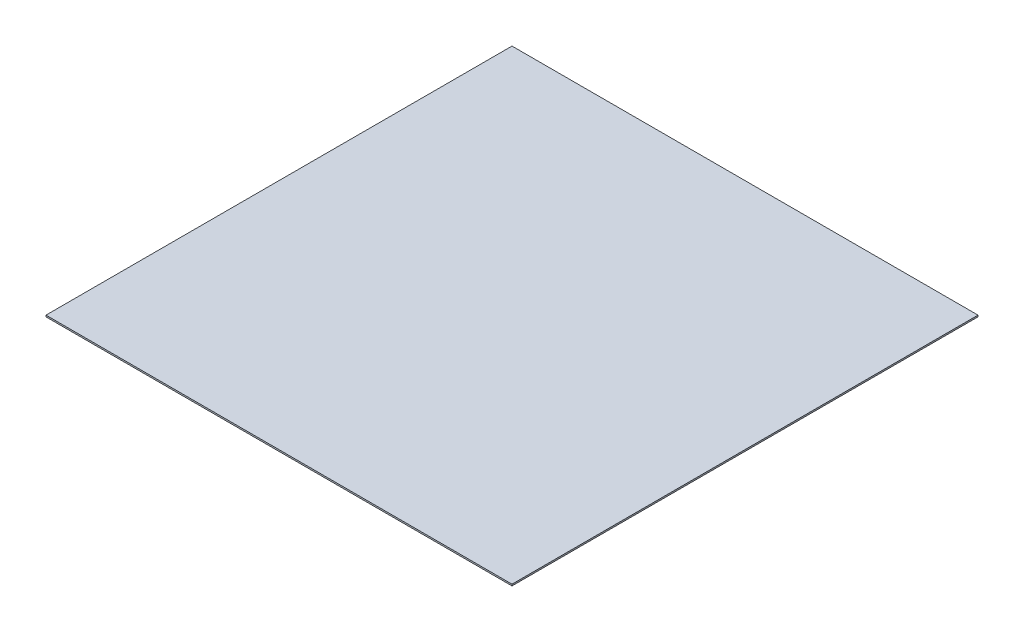
ISO-10303-21;
HEADER;
FILE_DESCRIPTION(('STEP AP214'),'2;1');
FILE_NAME('part.step','',(''),(''),'','','');
FILE_SCHEMA(('AUTOMOTIVE_DESIGN { 1 0 10303 214 1 1 1 1 }'));
ENDSEC;
DATA;
#1=APPLICATION_CONTEXT('core data for automotive mechanical design processes');
#2=APPLICATION_PROTOCOL_DEFINITION('international standard','automotive_design',2000,#1);
#3=PRODUCT_CONTEXT('',#1,'mechanical');
#4=PRODUCT('Part','Part','',(#3));
#5=PRODUCT_RELATED_PRODUCT_CATEGORY('part','',(#4));
#6=PRODUCT_DEFINITION_FORMATION('','',#4);
#7=PRODUCT_DEFINITION_CONTEXT('part definition',#1,'design');
#8=PRODUCT_DEFINITION('design','',#6,#7);
#9=PRODUCT_DEFINITION_SHAPE('','',#8);
#10=(LENGTH_UNIT() NAMED_UNIT(*) SI_UNIT(.MILLI.,.METRE.));
#11=(NAMED_UNIT(*) PLANE_ANGLE_UNIT() SI_UNIT($,.RADIAN.));
#12=(NAMED_UNIT(*) SI_UNIT($,.STERADIAN.) SOLID_ANGLE_UNIT());
#13=UNCERTAINTY_MEASURE_WITH_UNIT(LENGTH_MEASURE(1.E-05),#10,'distance_accuracy_value','');
#14=(GEOMETRIC_REPRESENTATION_CONTEXT(3) GLOBAL_UNCERTAINTY_ASSIGNED_CONTEXT((#13)) GLOBAL_UNIT_ASSIGNED_CONTEXT((#10,
#11,#12)) REPRESENTATION_CONTEXT('',''));
#15=CARTESIAN_POINT('',(0.,0.,0.));
#16=DIRECTION('',(0.,0.,1.));
#17=DIRECTION('',(1.,0.,0.));
#18=AXIS2_PLACEMENT_3D('',#15,#16,#17);
#19=CARTESIAN_POINT('',(0.,1.,0.));
#20=DIRECTION('',(1.,0.,0.));
#21=DIRECTION('',(0.,0.,-1.));
#22=AXIS2_PLACEMENT_3D('',#19,#20,#21);
#23=PLANE('',#22);
#24=DIRECTION('',(0.,0.,1.));
#25=VECTOR('',#24,1.);
#26=CARTESIAN_POINT('',(0.,0.,0.));
#27=LINE('',#26,#25);
#28=CARTESIAN_POINT('',(0.,0.,-300.));
#29=VERTEX_POINT('',#28);
#30=CARTESIAN_POINT('',(0.,0.,0.));
#31=VERTEX_POINT('',#30);
#32=EDGE_CURVE('E107',#29,#31,#27,.T.);
#33=ORIENTED_EDGE('',*,*,#32,.T.);
#34=DIRECTION('',(0.,-1.,0.));
#35=VECTOR('',#34,1.);
#36=CARTESIAN_POINT('',(0.,1.,0.));
#37=LINE('',#36,#35);
#38=CARTESIAN_POINT('',(0.,1.,0.));
#39=VERTEX_POINT('',#38);
#40=EDGE_CURVE('E11',#39,#31,#37,.T.);
#41=ORIENTED_EDGE('',*,*,#40,.F.);
#42=DIRECTION('',(0.,0.,1.));
#43=VECTOR('',#42,1.);
#44=CARTESIAN_POINT('',(0.,1.,0.));
#45=LINE('',#44,#43);
#46=CARTESIAN_POINT('',(0.,1.,-300.));
#47=VERTEX_POINT('',#46);
#48=EDGE_CURVE('E91',#47,#39,#45,.T.);
#49=ORIENTED_EDGE('',*,*,#48,.F.);
#50=DIRECTION('',(0.,-1.,0.));
#51=VECTOR('',#50,1.);
#52=CARTESIAN_POINT('',(0.,1.,-300.));
#53=LINE('',#52,#51);
#54=EDGE_CURVE('E103',#47,#29,#53,.T.);
#55=ORIENTED_EDGE('',*,*,#54,.T.);
#56=EDGE_LOOP('',(#33,#41,#49,#55));
#57=FACE_BOUND('',#56,.T.);
#58=ADVANCED_FACE('F39',(#57),#23,.F.);
#59=CARTESIAN_POINT('',(0.,1.,0.));
#60=DIRECTION('',(0.,0.,-1.));
#61=DIRECTION('',(-1.,0.,0.));
#62=AXIS2_PLACEMENT_3D('',#59,#60,#61);
#63=PLANE('',#62);
#64=DIRECTION('',(1.,0.,0.));
#65=VECTOR('',#64,1.);
#66=CARTESIAN_POINT('',(0.,0.,0.));
#67=LINE('',#66,#65);
#68=CARTESIAN_POINT('',(300.,0.,0.));
#69=VERTEX_POINT('',#68);
#70=EDGE_CURVE('E96',#31,#69,#67,.T.);
#71=ORIENTED_EDGE('',*,*,#70,.T.);
#72=DIRECTION('',(0.,-1.,0.));
#73=VECTOR('',#72,1.);
#74=CARTESIAN_POINT('',(300.,1.,0.));
#75=LINE('',#74,#73);
#76=CARTESIAN_POINT('',(300.,1.,0.));
#77=VERTEX_POINT('',#76);
#78=EDGE_CURVE('E48',#77,#69,#75,.T.);
#79=ORIENTED_EDGE('',*,*,#78,.F.);
#80=DIRECTION('',(1.,0.,0.));
#81=VECTOR('',#80,1.);
#82=CARTESIAN_POINT('',(0.,1.,0.));
#83=LINE('',#82,#81);
#84=EDGE_CURVE('E86',#39,#77,#83,.T.);
#85=ORIENTED_EDGE('',*,*,#84,.F.);
#86=ORIENTED_EDGE('',*,*,#40,.T.);
#87=EDGE_LOOP('',(#71,#79,#85,#86));
#88=FACE_BOUND('',#87,.T.);
#89=ADVANCED_FACE('F95',(#88),#63,.F.);
#90=CARTESIAN_POINT('',(300.,1.,0.));
#91=DIRECTION('',(-1.,0.,0.));
#92=DIRECTION('',(0.,0.,1.));
#93=AXIS2_PLACEMENT_3D('',#90,#91,#92);
#94=PLANE('',#93);
#95=DIRECTION('',(0.,0.,-1.));
#96=VECTOR('',#95,1.);
#97=CARTESIAN_POINT('',(300.,0.,0.));
#98=LINE('',#97,#96);
#99=CARTESIAN_POINT('',(300.,0.,-300.));
#100=VERTEX_POINT('',#99);
#101=EDGE_CURVE('E73',#69,#100,#98,.T.);
#102=ORIENTED_EDGE('',*,*,#101,.T.);
#103=DIRECTION('',(0.,-1.,0.));
#104=VECTOR('',#103,1.);
#105=CARTESIAN_POINT('',(300.,1.,-300.));
#106=LINE('',#105,#104);
#107=CARTESIAN_POINT('',(300.,1.,-300.));
#108=VERTEX_POINT('',#107);
#109=EDGE_CURVE('E98',#108,#100,#106,.T.);
#110=ORIENTED_EDGE('',*,*,#109,.F.);
#111=DIRECTION('',(0.,0.,-1.));
#112=VECTOR('',#111,1.);
#113=CARTESIAN_POINT('',(300.,1.,0.));
#114=LINE('',#113,#112);
#115=EDGE_CURVE('E89',#77,#108,#114,.T.);
#116=ORIENTED_EDGE('',*,*,#115,.F.);
#117=ORIENTED_EDGE('',*,*,#78,.T.);
#118=EDGE_LOOP('',(#102,#110,#116,#117));
#119=FACE_BOUND('',#118,.T.);
#120=ADVANCED_FACE('F99',(#119),#94,.F.);
#121=CARTESIAN_POINT('',(0.,1.,-300.));
#122=DIRECTION('',(0.,0.,1.));
#123=DIRECTION('',(1.,0.,0.));
#124=AXIS2_PLACEMENT_3D('',#121,#122,#123);
#125=PLANE('',#124);
#126=DIRECTION('',(-1.,0.,0.));
#127=VECTOR('',#126,1.);
#128=CARTESIAN_POINT('',(0.,0.,-300.));
#129=LINE('',#128,#127);
#130=EDGE_CURVE('E79',#100,#29,#129,.T.);
#131=ORIENTED_EDGE('',*,*,#130,.T.);
#132=ORIENTED_EDGE('',*,*,#54,.F.);
#133=DIRECTION('',(-1.,0.,0.));
#134=VECTOR('',#133,1.);
#135=CARTESIAN_POINT('',(0.,1.,-300.));
#136=LINE('',#135,#134);
#137=EDGE_CURVE('E56',#108,#47,#136,.T.);
#138=ORIENTED_EDGE('',*,*,#137,.F.);
#139=ORIENTED_EDGE('',*,*,#109,.T.);
#140=EDGE_LOOP('',(#131,#132,#138,#139));
#141=FACE_BOUND('',#140,.T.);
#142=ADVANCED_FACE('F120',(#141),#125,.F.);
#143=CARTESIAN_POINT('',(0.,1.,0.));
#144=DIRECTION('',(0.,-1.,0.));
#145=DIRECTION('',(0.,0.,-1.));
#146=AXIS2_PLACEMENT_3D('',#143,#144,#145);
#147=PLANE('',#146);
#148=ORIENTED_EDGE('',*,*,#48,.T.);
#149=ORIENTED_EDGE('',*,*,#84,.T.);
#150=ORIENTED_EDGE('',*,*,#115,.T.);
#151=ORIENTED_EDGE('',*,*,#137,.T.);
#152=EDGE_LOOP('',(#148,#149,#150,#151));
#153=FACE_BOUND('',#152,.T.);
#154=ADVANCED_FACE('F87',(#153),#147,.F.);
#155=CARTESIAN_POINT('',(0.,0.,0.));
#156=DIRECTION('',(0.,-1.,0.));
#157=DIRECTION('',(0.,0.,-1.));
#158=AXIS2_PLACEMENT_3D('',#155,#156,#157);
#159=PLANE('',#158);
#160=ORIENTED_EDGE('',*,*,#32,.F.);
#161=ORIENTED_EDGE('',*,*,#130,.F.);
#162=ORIENTED_EDGE('',*,*,#101,.F.);
#163=ORIENTED_EDGE('',*,*,#70,.F.);
#164=EDGE_LOOP('',(#160,#161,#162,#163));
#165=FACE_BOUND('',#164,.T.);
#166=ADVANCED_FACE('F123',(#165),#159,.T.);
#167=CLOSED_SHELL('',(#58,#89,#120,#142,#154,#166));
#168=MANIFOLD_SOLID_BREP('B2',#167);
#169=ADVANCED_BREP_SHAPE_REPRESENTATION('',(#18,#168),#14);
#170=SHAPE_DEFINITION_REPRESENTATION(#9,#169);
ENDSEC;
END-ISO-10303-21;
